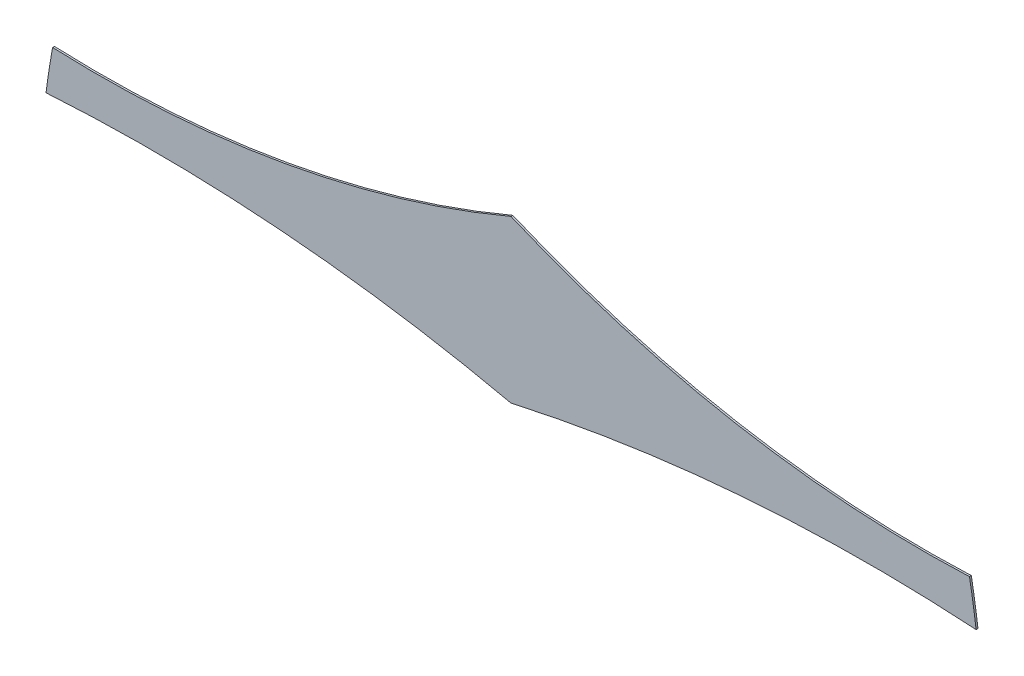
ISO-10303-21;
HEADER;
FILE_DESCRIPTION(('STEP AP214'),'2;1');
FILE_NAME('part.step','',(''),(''),'','','');
FILE_SCHEMA(('AUTOMOTIVE_DESIGN { 1 0 10303 214 1 1 1 1 }'));
ENDSEC;
DATA;
#1=APPLICATION_CONTEXT('core data for automotive mechanical design processes');
#2=APPLICATION_PROTOCOL_DEFINITION('international standard','automotive_design',2000,#1);
#3=PRODUCT_CONTEXT('',#1,'mechanical');
#4=PRODUCT('Part','Part','',(#3));
#5=PRODUCT_RELATED_PRODUCT_CATEGORY('part','',(#4));
#6=PRODUCT_DEFINITION_FORMATION('','',#4);
#7=PRODUCT_DEFINITION_CONTEXT('part definition',#1,'design');
#8=PRODUCT_DEFINITION('design','',#6,#7);
#9=PRODUCT_DEFINITION_SHAPE('','',#8);
#10=(LENGTH_UNIT() NAMED_UNIT(*) SI_UNIT(.MILLI.,.METRE.));
#11=(NAMED_UNIT(*) PLANE_ANGLE_UNIT() SI_UNIT($,.RADIAN.));
#12=(NAMED_UNIT(*) SI_UNIT($,.STERADIAN.) SOLID_ANGLE_UNIT());
#13=UNCERTAINTY_MEASURE_WITH_UNIT(LENGTH_MEASURE(1.E-05),#10,'distance_accuracy_value','');
#14=(GEOMETRIC_REPRESENTATION_CONTEXT(3) GLOBAL_UNCERTAINTY_ASSIGNED_CONTEXT((#13)) GLOBAL_UNIT_ASSIGNED_CONTEXT((#10,
#11,#12)) REPRESENTATION_CONTEXT('',''));
#15=CARTESIAN_POINT('',(0.,0.,0.));
#16=DIRECTION('',(0.,0.,1.));
#17=DIRECTION('',(1.,0.,0.));
#18=AXIS2_PLACEMENT_3D('',#15,#16,#17);
#19=CARTESIAN_POINT('',(16.6148481728268,-59.0421359798867,0.1));
#20=DIRECTION('',(0.,0.,-1.));
#21=DIRECTION('',(-1.,0.,0.));
#22=AXIS2_PLACEMENT_3D('',#19,#20,#21);
#23=CYLINDRICAL_SURFACE('',#22,88.0660500705624);
#24=CARTESIAN_POINT('',(16.6148481728268,-59.0421359798867,0.));
#25=DIRECTION('',(0.,0.,1.));
#26=DIRECTION('',(1.,0.,0.));
#27=AXIS2_PLACEMENT_3D('',#24,#25,#26);
#28=CIRCLE('',#27,88.0660500705624);
#29=CARTESIAN_POINT('',(35.8002108027665,26.9087280983092,0.));
#30=VERTEX_POINT('',#29);
#31=CARTESIAN_POINT('',(10.9699909095393,28.8428158691523,0.));
#32=VERTEX_POINT('',#31);
#33=EDGE_CURVE('E114',#30,#32,#28,.T.);
#34=ORIENTED_EDGE('',*,*,#33,.F.);
#35=DIRECTION('',(0.,0.,-1.));
#36=VECTOR('',#35,1.);
#37=CARTESIAN_POINT('',(35.8002108027665,26.9087280983092,0.1));
#38=LINE('',#37,#36);
#39=CARTESIAN_POINT('',(35.8002108027665,26.9087280983092,0.1));
#40=VERTEX_POINT('',#39);
#41=EDGE_CURVE('E11',#40,#30,#38,.T.);
#42=ORIENTED_EDGE('',*,*,#41,.F.);
#43=CARTESIAN_POINT('',(16.6148481728268,-59.0421359798867,0.1));
#44=DIRECTION('',(0.,0.,1.));
#45=DIRECTION('',(1.,0.,0.));
#46=AXIS2_PLACEMENT_3D('',#43,#44,#45);
#47=CIRCLE('',#46,88.0660500705624);
#48=CARTESIAN_POINT('',(10.9699909095393,28.8428158691523,0.1));
#49=VERTEX_POINT('',#48);
#50=EDGE_CURVE('E128',#40,#49,#47,.T.);
#51=ORIENTED_EDGE('',*,*,#50,.T.);
#52=DIRECTION('',(0.,0.,-1.));
#53=VECTOR('',#52,1.);
#54=CARTESIAN_POINT('',(10.9699909095393,28.8428158691523,0.1));
#55=LINE('',#54,#53);
#56=EDGE_CURVE('E77',#49,#32,#55,.T.);
#57=ORIENTED_EDGE('',*,*,#56,.T.);
#58=EDGE_LOOP('',(#34,#42,#51,#57));
#59=FACE_BOUND('',#58,.T.);
#60=ADVANCED_FACE('F33',(#59),#23,.F.);
#61=CARTESIAN_POINT('',(55.0169140645622,-59.045427380226,0.1));
#62=DIRECTION('',(0.,0.,-1.));
#63=DIRECTION('',(-1.,0.,0.));
#64=AXIS2_PLACEMENT_3D('',#61,#62,#63);
#65=CYLINDRICAL_SURFACE('',#64,88.0760951012255);
#66=CARTESIAN_POINT('',(55.0169140645622,-59.045427380226,0.));
#67=DIRECTION('',(0.,0.,1.));
#68=DIRECTION('',(1.,0.,0.));
#69=AXIS2_PLACEMENT_3D('',#66,#67,#68);
#70=CIRCLE('',#69,88.0760951012255);
#71=CARTESIAN_POINT('',(60.6360424672279,28.8512387924706,0.));
#72=VERTEX_POINT('',#71);
#73=EDGE_CURVE('E117',#72,#30,#70,.T.);
#74=ORIENTED_EDGE('',*,*,#73,.F.);
#75=DIRECTION('',(0.,0.,-1.));
#76=VECTOR('',#75,1.);
#77=CARTESIAN_POINT('',(60.6360424672279,28.8512387924706,0.1));
#78=LINE('',#77,#76);
#79=CARTESIAN_POINT('',(60.6360424672279,28.8512387924706,0.1));
#80=VERTEX_POINT('',#79);
#81=EDGE_CURVE('E41',#80,#72,#78,.T.);
#82=ORIENTED_EDGE('',*,*,#81,.F.);
#83=CARTESIAN_POINT('',(55.0169140645622,-59.045427380226,0.1));
#84=DIRECTION('',(0.,0.,1.));
#85=DIRECTION('',(1.,0.,0.));
#86=AXIS2_PLACEMENT_3D('',#83,#84,#85);
#87=CIRCLE('',#86,88.0760951012255);
#88=EDGE_CURVE('E140',#80,#40,#87,.T.);
#89=ORIENTED_EDGE('',*,*,#88,.T.);
#90=ORIENTED_EDGE('',*,*,#41,.T.);
#91=EDGE_LOOP('',(#74,#82,#89,#90));
#92=FACE_BOUND('',#91,.T.);
#93=ADVANCED_FACE('F139',(#92),#65,.F.);
#94=CARTESIAN_POINT('',(14.8172548113122,22.8356107139578,0.1));
#95=DIRECTION('',(0.,0.,-1.));
#96=DIRECTION('',(-1.,0.,0.));
#97=AXIS2_PLACEMENT_3D('',#94,#95,#96);
#98=CYLINDRICAL_SURFACE('',#97,46.2120015086654);
#99=CARTESIAN_POINT('',(14.8172548113122,22.8356107139578,0.));
#100=DIRECTION('',(0.,0.,1.));
#101=DIRECTION('',(1.,0.,0.));
#102=AXIS2_PLACEMENT_3D('',#99,#100,#101);
#103=CIRCLE('',#102,46.2120015086654);
#104=CARTESIAN_POINT('',(60.2798177543806,31.1244257127641,0.));
#105=VERTEX_POINT('',#104);
#106=EDGE_CURVE('E120',#72,#105,#103,.T.);
#107=ORIENTED_EDGE('',*,*,#106,.T.);
#108=DIRECTION('',(0.,0.,-1.));
#109=VECTOR('',#108,1.);
#110=CARTESIAN_POINT('',(60.2798177543806,31.1244257127641,0.1));
#111=LINE('',#110,#109);
#112=CARTESIAN_POINT('',(60.2798177543806,31.1244257127641,0.1));
#113=VERTEX_POINT('',#112);
#114=EDGE_CURVE('E100',#113,#105,#111,.T.);
#115=ORIENTED_EDGE('',*,*,#114,.F.);
#116=CARTESIAN_POINT('',(14.8172548113122,22.8356107139578,0.1));
#117=DIRECTION('',(0.,0.,1.));
#118=DIRECTION('',(1.,0.,0.));
#119=AXIS2_PLACEMENT_3D('',#116,#117,#118);
#120=CIRCLE('',#119,46.2120015086654);
#121=EDGE_CURVE('E106',#80,#113,#120,.T.);
#122=ORIENTED_EDGE('',*,*,#121,.F.);
#123=ORIENTED_EDGE('',*,*,#81,.T.);
#124=EDGE_LOOP('',(#107,#115,#122,#123));
#125=FACE_BOUND('',#124,.T.);
#126=ADVANCED_FACE('F133',(#125),#98,.T.);
#127=CARTESIAN_POINT('',(57.8236669040294,87.5816418074482,0.1));
#128=DIRECTION('',(0.,0.,-1.));
#129=DIRECTION('',(-1.,0.,0.));
#130=AXIS2_PLACEMENT_3D('',#127,#128,#129);
#131=CYLINDRICAL_SURFACE('',#130,56.5106178179069);
#132=CARTESIAN_POINT('',(57.8236669040294,87.5816418074482,0.));
#133=DIRECTION('',(0.,0.,1.));
#134=DIRECTION('',(1.,0.,0.));
#135=AXIS2_PLACEMENT_3D('',#132,#133,#134);
#136=CIRCLE('',#135,56.5106178179069);
#137=CARTESIAN_POINT('',(35.7980506933377,35.5400992025172,0.));
#138=VERTEX_POINT('',#137);
#139=EDGE_CURVE('E95',#138,#105,#136,.T.);
#140=ORIENTED_EDGE('',*,*,#139,.F.);
#141=DIRECTION('',(0.,0.,-1.));
#142=VECTOR('',#141,1.);
#143=CARTESIAN_POINT('',(35.7980506933377,35.5400992025172,0.1));
#144=LINE('',#143,#142);
#145=CARTESIAN_POINT('',(35.7980506933377,35.5400992025172,0.1));
#146=VERTEX_POINT('',#145);
#147=EDGE_CURVE('E90',#146,#138,#144,.T.);
#148=ORIENTED_EDGE('',*,*,#147,.F.);
#149=CARTESIAN_POINT('',(57.8236669040294,87.5816418074482,0.1));
#150=DIRECTION('',(0.,0.,1.));
#151=DIRECTION('',(1.,0.,0.));
#152=AXIS2_PLACEMENT_3D('',#149,#150,#151);
#153=CIRCLE('',#152,56.5106178179069);
#154=EDGE_CURVE('E93',#146,#113,#153,.T.);
#155=ORIENTED_EDGE('',*,*,#154,.T.);
#156=ORIENTED_EDGE('',*,*,#114,.T.);
#157=EDGE_LOOP('',(#140,#148,#155,#156));
#158=FACE_BOUND('',#157,.T.);
#159=ADVANCED_FACE('F92',(#158),#131,.F.);
#160=CARTESIAN_POINT('',(13.7564073280629,87.5647418060808,0.1));
#161=DIRECTION('',(0.,0.,-1.));
#162=DIRECTION('',(-1.,0.,0.));
#163=AXIS2_PLACEMENT_3D('',#160,#161,#162);
#164=CYLINDRICAL_SURFACE('',#163,56.5013051200632);
#165=CARTESIAN_POINT('',(13.7564073280629,87.5647418060808,0.));
#166=DIRECTION('',(0.,0.,1.));
#167=DIRECTION('',(1.,0.,0.));
#168=AXIS2_PLACEMENT_3D('',#165,#166,#167);
#169=CIRCLE('',#168,56.5013051200632);
#170=CARTESIAN_POINT('',(11.3219878653383,31.1159058380115,0.));
#171=VERTEX_POINT('',#170);
#172=EDGE_CURVE('E124',#171,#138,#169,.T.);
#173=ORIENTED_EDGE('',*,*,#172,.F.);
#174=DIRECTION('',(0.,0.,-1.));
#175=VECTOR('',#174,1.);
#176=CARTESIAN_POINT('',(11.3219878653383,31.1159058380115,0.1));
#177=LINE('',#176,#175);
#178=CARTESIAN_POINT('',(11.3219878653383,31.1159058380115,0.1));
#179=VERTEX_POINT('',#178);
#180=EDGE_CURVE('E70',#179,#171,#177,.T.);
#181=ORIENTED_EDGE('',*,*,#180,.F.);
#182=CARTESIAN_POINT('',(13.7564073280629,87.5647418060808,0.1));
#183=DIRECTION('',(0.,0.,1.));
#184=DIRECTION('',(1.,0.,0.));
#185=AXIS2_PLACEMENT_3D('',#182,#183,#184);
#186=CIRCLE('',#185,56.5013051200632);
#187=EDGE_CURVE('E103',#179,#146,#186,.T.);
#188=ORIENTED_EDGE('',*,*,#187,.T.);
#189=ORIENTED_EDGE('',*,*,#147,.T.);
#190=EDGE_LOOP('',(#173,#181,#188,#189));
#191=FACE_BOUND('',#190,.T.);
#192=ADVANCED_FACE('F109',(#191),#164,.F.);
#193=CARTESIAN_POINT('',(56.7985837849145,22.909876375455,0.1));
#194=DIRECTION('',(0.,0.,-1.));
#195=DIRECTION('',(-1.,0.,0.));
#196=AXIS2_PLACEMENT_3D('',#193,#194,#195);
#197=CYLINDRICAL_SURFACE('',#196,46.2110343529851);
#198=CARTESIAN_POINT('',(56.7985837849145,22.909876375455,0.));
#199=DIRECTION('',(0.,0.,1.));
#200=DIRECTION('',(1.,0.,0.));
#201=AXIS2_PLACEMENT_3D('',#198,#199,#200);
#202=CIRCLE('',#201,46.2110343529851);
#203=EDGE_CURVE('E126',#171,#32,#202,.T.);
#204=ORIENTED_EDGE('',*,*,#203,.T.);
#205=ORIENTED_EDGE('',*,*,#56,.F.);
#206=CARTESIAN_POINT('',(56.7985837849145,22.909876375455,0.1));
#207=DIRECTION('',(0.,0.,1.));
#208=DIRECTION('',(1.,0.,0.));
#209=AXIS2_PLACEMENT_3D('',#206,#207,#208);
#210=CIRCLE('',#209,46.2110343529851);
#211=EDGE_CURVE('E49',#179,#49,#210,.T.);
#212=ORIENTED_EDGE('',*,*,#211,.F.);
#213=ORIENTED_EDGE('',*,*,#180,.T.);
#214=EDGE_LOOP('',(#204,#205,#212,#213));
#215=FACE_BOUND('',#214,.T.);
#216=ADVANCED_FACE('F141',(#215),#197,.T.);
#217=CARTESIAN_POINT('',(0.,0.,0.1));
#218=DIRECTION('',(0.,0.,1.));
#219=DIRECTION('',(1.,0.,0.));
#220=AXIS2_PLACEMENT_3D('',#217,#218,#219);
#221=PLANE('',#220);
#222=ORIENTED_EDGE('',*,*,#50,.F.);
#223=ORIENTED_EDGE('',*,*,#88,.F.);
#224=ORIENTED_EDGE('',*,*,#121,.T.);
#225=ORIENTED_EDGE('',*,*,#154,.F.);
#226=ORIENTED_EDGE('',*,*,#187,.F.);
#227=ORIENTED_EDGE('',*,*,#211,.T.);
#228=EDGE_LOOP('',(#222,#223,#224,#225,#226,#227));
#229=FACE_BOUND('',#228,.T.);
#230=ADVANCED_FACE('F102',(#229),#221,.T.);
#231=CARTESIAN_POINT('',(0.,0.,0.));
#232=DIRECTION('',(0.,0.,1.));
#233=DIRECTION('',(1.,0.,0.));
#234=AXIS2_PLACEMENT_3D('',#231,#232,#233);
#235=PLANE('',#234);
#236=ORIENTED_EDGE('',*,*,#33,.T.);
#237=ORIENTED_EDGE('',*,*,#203,.F.);
#238=ORIENTED_EDGE('',*,*,#172,.T.);
#239=ORIENTED_EDGE('',*,*,#139,.T.);
#240=ORIENTED_EDGE('',*,*,#106,.F.);
#241=ORIENTED_EDGE('',*,*,#73,.T.);
#242=EDGE_LOOP('',(#236,#237,#238,#239,#240,#241));
#243=FACE_BOUND('',#242,.T.);
#244=ADVANCED_FACE('F138',(#243),#235,.F.);
#245=CLOSED_SHELL('',(#60,#93,#126,#159,#192,#216,#230,#244));
#246=MANIFOLD_SOLID_BREP('B2',#245);
#247=ADVANCED_BREP_SHAPE_REPRESENTATION('',(#18,#246),#14);
#248=SHAPE_DEFINITION_REPRESENTATION(#9,#247);
ENDSEC;
END-ISO-10303-21;
